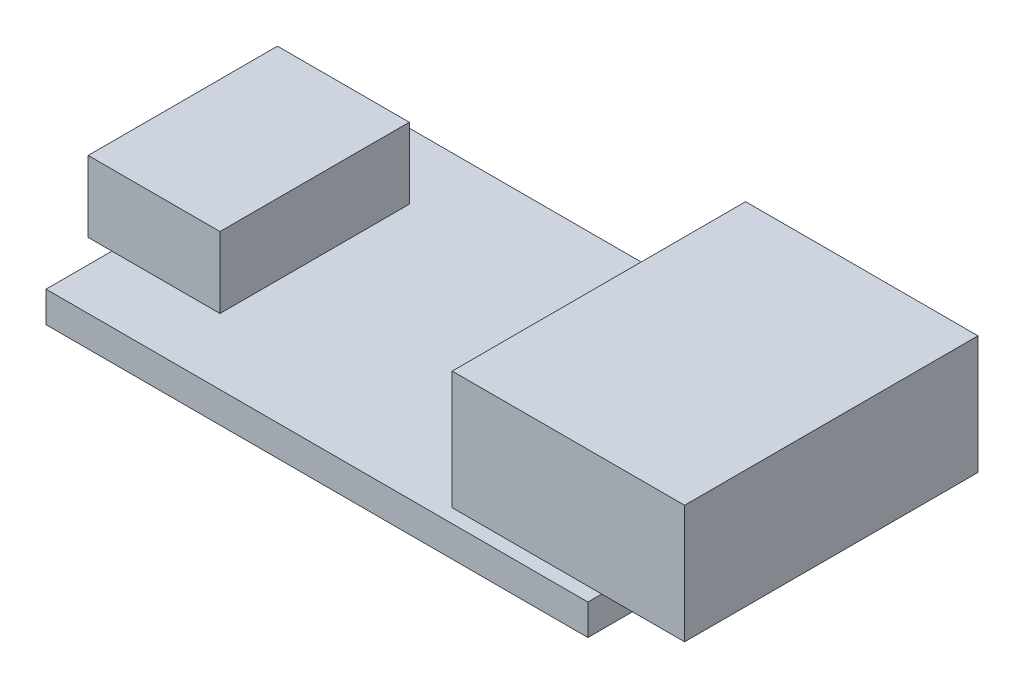
ISO-10303-21;
HEADER;
FILE_DESCRIPTION(('STEP AP214'),'2;1');
FILE_NAME('part.step','',(''),(''),'','','');
FILE_SCHEMA(('AUTOMOTIVE_DESIGN { 1 0 10303 214 1 1 1 1 }'));
ENDSEC;
DATA;
#1=APPLICATION_CONTEXT('core data for automotive mechanical design processes');
#2=APPLICATION_PROTOCOL_DEFINITION('international standard','automotive_design',2000,#1);
#3=PRODUCT_CONTEXT('',#1,'mechanical');
#4=PRODUCT('Part','Part','',(#3));
#5=PRODUCT_RELATED_PRODUCT_CATEGORY('part','',(#4));
#6=PRODUCT_DEFINITION_FORMATION('','',#4);
#7=PRODUCT_DEFINITION_CONTEXT('part definition',#1,'design');
#8=PRODUCT_DEFINITION('design','',#6,#7);
#9=PRODUCT_DEFINITION_SHAPE('','',#8);
#10=(LENGTH_UNIT() NAMED_UNIT(*) SI_UNIT(.MILLI.,.METRE.));
#11=(NAMED_UNIT(*) PLANE_ANGLE_UNIT() SI_UNIT($,.RADIAN.));
#12=(NAMED_UNIT(*) SI_UNIT($,.STERADIAN.) SOLID_ANGLE_UNIT());
#13=UNCERTAINTY_MEASURE_WITH_UNIT(LENGTH_MEASURE(1.E-05),#10,'distance_accuracy_value','');
#14=(GEOMETRIC_REPRESENTATION_CONTEXT(3) GLOBAL_UNCERTAINTY_ASSIGNED_CONTEXT((#13)) GLOBAL_UNIT_ASSIGNED_CONTEXT((#10,
#11,#12)) REPRESENTATION_CONTEXT('',''));
#15=CARTESIAN_POINT('',(0.,0.,0.));
#16=DIRECTION('',(0.,0.,1.));
#17=DIRECTION('',(1.,0.,0.));
#18=AXIS2_PLACEMENT_3D('',#15,#16,#17);
#19=CARTESIAN_POINT('',(-1.0034098301378,3.,-4.));
#20=DIRECTION('',(1.,0.,0.));
#21=DIRECTION('',(0.,0.,-1.));
#22=AXIS2_PLACEMENT_3D('',#19,#20,#21);
#23=PLANE('',#22);
#24=DIRECTION('',(0.,0.,1.));
#25=VECTOR('',#24,1.);
#26=CARTESIAN_POINT('',(-1.0034098301378,0.,-4.));
#27=LINE('',#26,#25);
#28=CARTESIAN_POINT('',(-1.0034098301378,0.,-4.));
#29=VERTEX_POINT('',#28);
#30=CARTESIAN_POINT('',(-1.0034098301378,0.,4.));
#31=VERTEX_POINT('',#30);
#32=EDGE_CURVE('E109',#29,#31,#27,.T.);
#33=ORIENTED_EDGE('',*,*,#32,.T.);
#34=DIRECTION('',(0.,-1.,0.));
#35=VECTOR('',#34,1.);
#36=CARTESIAN_POINT('',(-1.0034098301378,3.,4.));
#37=LINE('',#36,#35);
#38=CARTESIAN_POINT('',(-1.0034098301378,3.,4.));
#39=VERTEX_POINT('',#38);
#40=EDGE_CURVE('E12',#39,#31,#37,.T.);
#41=ORIENTED_EDGE('',*,*,#40,.F.);
#42=DIRECTION('',(0.,0.,1.));
#43=VECTOR('',#42,1.);
#44=CARTESIAN_POINT('',(-1.0034098301378,3.,-4.));
#45=LINE('',#44,#43);
#46=CARTESIAN_POINT('',(-1.0034098301378,3.,-4.));
#47=VERTEX_POINT('',#46);
#48=EDGE_CURVE('E95',#47,#39,#45,.T.);
#49=ORIENTED_EDGE('',*,*,#48,.F.);
#50=DIRECTION('',(0.,-1.,0.));
#51=VECTOR('',#50,1.);
#52=CARTESIAN_POINT('',(-1.0034098301378,3.,-4.));
#53=LINE('',#52,#51);
#54=EDGE_CURVE('E62',#47,#29,#53,.T.);
#55=ORIENTED_EDGE('',*,*,#54,.T.);
#56=EDGE_LOOP('',(#33,#41,#49,#55));
#57=FACE_BOUND('',#56,.T.);
#58=ADVANCED_FACE('F46',(#57),#23,.F.);
#59=CARTESIAN_POINT('',(-1.0034098301378,3.,4.));
#60=DIRECTION('',(0.,0.,-1.));
#61=DIRECTION('',(-1.,0.,0.));
#62=AXIS2_PLACEMENT_3D('',#59,#60,#61);
#63=PLANE('',#62);
#64=DIRECTION('',(1.,0.,0.));
#65=VECTOR('',#64,1.);
#66=CARTESIAN_POINT('',(-1.0034098301378,0.,4.));
#67=LINE('',#66,#65);
#68=CARTESIAN_POINT('',(4.5665901698622,0.,4.));
#69=VERTEX_POINT('',#68);
#70=EDGE_CURVE('E100',#31,#69,#67,.T.);
#71=ORIENTED_EDGE('',*,*,#70,.T.);
#72=DIRECTION('',(0.,-1.,0.));
#73=VECTOR('',#72,1.);
#74=CARTESIAN_POINT('',(4.5665901698622,3.,4.));
#75=LINE('',#74,#73);
#76=CARTESIAN_POINT('',(4.5665901698622,3.,4.));
#77=VERTEX_POINT('',#76);
#78=EDGE_CURVE('E54',#77,#69,#75,.T.);
#79=ORIENTED_EDGE('',*,*,#78,.F.);
#80=DIRECTION('',(1.,0.,0.));
#81=VECTOR('',#80,1.);
#82=CARTESIAN_POINT('',(-1.0034098301378,3.,4.));
#83=LINE('',#82,#81);
#84=EDGE_CURVE('E87',#39,#77,#83,.T.);
#85=ORIENTED_EDGE('',*,*,#84,.F.);
#86=ORIENTED_EDGE('',*,*,#40,.T.);
#87=EDGE_LOOP('',(#71,#79,#85,#86));
#88=FACE_BOUND('',#87,.T.);
#89=ADVANCED_FACE('F99',(#88),#63,.F.);
#90=CARTESIAN_POINT('',(4.5665901698622,3.,-4.));
#91=DIRECTION('',(1.,0.,0.));
#92=DIRECTION('',(0.,0.,-1.));
#93=AXIS2_PLACEMENT_3D('',#90,#91,#92);
#94=PLANE('',#93);
#95=DIRECTION('',(0.,0.,1.));
#96=VECTOR('',#95,1.);
#97=CARTESIAN_POINT('',(4.5665901698622,0.,-4.));
#98=LINE('',#97,#96);
#99=CARTESIAN_POINT('',(4.5665901698622,0.,-4.));
#100=VERTEX_POINT('',#99);
#101=EDGE_CURVE('E112',#100,#69,#98,.T.);
#102=ORIENTED_EDGE('',*,*,#101,.F.);
#103=DIRECTION('',(0.,-1.,0.));
#104=VECTOR('',#103,1.);
#105=CARTESIAN_POINT('',(4.5665901698622,3.,-4.));
#106=LINE('',#105,#104);
#107=CARTESIAN_POINT('',(4.5665901698622,3.,-4.));
#108=VERTEX_POINT('',#107);
#109=EDGE_CURVE('E76',#108,#100,#106,.T.);
#110=ORIENTED_EDGE('',*,*,#109,.F.);
#111=DIRECTION('',(0.,0.,1.));
#112=VECTOR('',#111,1.);
#113=CARTESIAN_POINT('',(4.5665901698622,3.,-4.));
#114=LINE('',#113,#112);
#115=EDGE_CURVE('E94',#108,#77,#114,.T.);
#116=ORIENTED_EDGE('',*,*,#115,.T.);
#117=ORIENTED_EDGE('',*,*,#78,.T.);
#118=EDGE_LOOP('',(#102,#110,#116,#117));
#119=FACE_BOUND('',#118,.T.);
#120=ADVANCED_FACE('F103',(#119),#94,.T.);
#121=CARTESIAN_POINT('',(-1.0034098301378,3.,-4.));
#122=DIRECTION('',(0.,0.,-1.));
#123=DIRECTION('',(-1.,0.,0.));
#124=AXIS2_PLACEMENT_3D('',#121,#122,#123);
#125=PLANE('',#124);
#126=DIRECTION('',(1.,0.,0.));
#127=VECTOR('',#126,1.);
#128=CARTESIAN_POINT('',(-1.0034098301378,0.,-4.));
#129=LINE('',#128,#127);
#130=EDGE_CURVE('E114',#29,#100,#129,.T.);
#131=ORIENTED_EDGE('',*,*,#130,.F.);
#132=ORIENTED_EDGE('',*,*,#54,.F.);
#133=DIRECTION('',(1.,0.,0.));
#134=VECTOR('',#133,1.);
#135=CARTESIAN_POINT('',(-1.0034098301378,3.,-4.));
#136=LINE('',#135,#134);
#137=EDGE_CURVE('E104',#47,#108,#136,.T.);
#138=ORIENTED_EDGE('',*,*,#137,.T.);
#139=ORIENTED_EDGE('',*,*,#109,.T.);
#140=EDGE_LOOP('',(#131,#132,#138,#139));
#141=FACE_BOUND('',#140,.T.);
#142=ADVANCED_FACE('F120',(#141),#125,.T.);
#143=CARTESIAN_POINT('',(0.,3.,0.));
#144=DIRECTION('',(0.,1.,0.));
#145=DIRECTION('',(0.,0.,1.));
#146=AXIS2_PLACEMENT_3D('',#143,#144,#145);
#147=PLANE('',#146);
#148=ORIENTED_EDGE('',*,*,#48,.T.);
#149=ORIENTED_EDGE('',*,*,#84,.T.);
#150=ORIENTED_EDGE('',*,*,#115,.F.);
#151=ORIENTED_EDGE('',*,*,#137,.F.);
#152=EDGE_LOOP('',(#148,#149,#150,#151));
#153=FACE_BOUND('',#152,.T.);
#154=ADVANCED_FACE('F91',(#153),#147,.T.);
#155=CARTESIAN_POINT('',(0.,0.,0.));
#156=DIRECTION('',(0.,1.,0.));
#157=DIRECTION('',(0.,0.,1.));
#158=AXIS2_PLACEMENT_3D('',#155,#156,#157);
#159=PLANE('',#158);
#160=ORIENTED_EDGE('',*,*,#32,.F.);
#161=ORIENTED_EDGE('',*,*,#130,.T.);
#162=ORIENTED_EDGE('',*,*,#101,.T.);
#163=ORIENTED_EDGE('',*,*,#70,.F.);
#164=EDGE_LOOP('',(#160,#161,#162,#163));
#165=FACE_BOUND('',#164,.T.);
#166=ADVANCED_FACE('F119',(#165),#159,.F.);
#167=CLOSED_SHELL('',(#58,#89,#120,#142,#154,#166));
#168=MANIFOLD_SOLID_BREP('B2',#167);
#169=CARTESIAN_POINT('',(26.4,5.,-6.2));
#170=DIRECTION('',(0.,0.,1.));
#171=DIRECTION('',(1.,0.,0.));
#172=AXIS2_PLACEMENT_3D('',#169,#170,#171);
#173=PLANE('',#172);
#174=DIRECTION('',(-1.,0.,0.));
#175=VECTOR('',#174,1.);
#176=CARTESIAN_POINT('',(26.4,0.,-6.2));
#177=LINE('',#176,#175);
#178=CARTESIAN_POINT('',(26.4,0.,-6.2));
#179=VERTEX_POINT('',#178);
#180=CARTESIAN_POINT('',(16.58,0.,-6.2));
#181=VERTEX_POINT('',#180);
#182=EDGE_CURVE('E242',#179,#181,#177,.T.);
#183=ORIENTED_EDGE('',*,*,#182,.T.);
#184=DIRECTION('',(0.,-1.,0.));
#185=VECTOR('',#184,1.);
#186=CARTESIAN_POINT('',(16.58,5.,-6.2));
#187=LINE('',#186,#185);
#188=CARTESIAN_POINT('',(16.58,5.,-6.2));
#189=VERTEX_POINT('',#188);
#190=EDGE_CURVE('E44',#189,#181,#187,.T.);
#191=ORIENTED_EDGE('',*,*,#190,.F.);
#192=DIRECTION('',(-1.,0.,0.));
#193=VECTOR('',#192,1.);
#194=CARTESIAN_POINT('',(26.4,5.,-6.2));
#195=LINE('',#194,#193);
#196=CARTESIAN_POINT('',(26.4,5.,-6.2));
#197=VERTEX_POINT('',#196);
#198=EDGE_CURVE('E228',#197,#189,#195,.T.);
#199=ORIENTED_EDGE('',*,*,#198,.F.);
#200=DIRECTION('',(0.,-1.,0.));
#201=VECTOR('',#200,1.);
#202=CARTESIAN_POINT('',(26.4,5.,-6.2));
#203=LINE('',#202,#201);
#204=EDGE_CURVE('E195',#197,#179,#203,.T.);
#205=ORIENTED_EDGE('',*,*,#204,.T.);
#206=EDGE_LOOP('',(#183,#191,#199,#205));
#207=FACE_BOUND('',#206,.T.);
#208=ADVANCED_FACE('F179',(#207),#173,.F.);
#209=CARTESIAN_POINT('',(16.58,5.,-6.2));
#210=DIRECTION('',(1.,0.,0.));
#211=DIRECTION('',(0.,0.,-1.));
#212=AXIS2_PLACEMENT_3D('',#209,#210,#211);
#213=PLANE('',#212);
#214=DIRECTION('',(0.,0.,1.));
#215=VECTOR('',#214,1.);
#216=CARTESIAN_POINT('',(16.58,0.,-6.2));
#217=LINE('',#216,#215);
#218=CARTESIAN_POINT('',(16.58,0.,6.2));
#219=VERTEX_POINT('',#218);
#220=EDGE_CURVE('E233',#181,#219,#217,.T.);
#221=ORIENTED_EDGE('',*,*,#220,.T.);
#222=DIRECTION('',(0.,-1.,0.));
#223=VECTOR('',#222,1.);
#224=CARTESIAN_POINT('',(16.58,5.,6.2));
#225=LINE('',#224,#223);
#226=CARTESIAN_POINT('',(16.58,5.,6.2));
#227=VERTEX_POINT('',#226);
#228=EDGE_CURVE('E187',#227,#219,#225,.T.);
#229=ORIENTED_EDGE('',*,*,#228,.F.);
#230=DIRECTION('',(0.,0.,1.));
#231=VECTOR('',#230,1.);
#232=CARTESIAN_POINT('',(16.58,5.,-6.2));
#233=LINE('',#232,#231);
#234=EDGE_CURVE('E220',#189,#227,#233,.T.);
#235=ORIENTED_EDGE('',*,*,#234,.F.);
#236=ORIENTED_EDGE('',*,*,#190,.T.);
#237=EDGE_LOOP('',(#221,#229,#235,#236));
#238=FACE_BOUND('',#237,.T.);
#239=ADVANCED_FACE('F232',(#238),#213,.F.);
#240=CARTESIAN_POINT('',(26.4,5.,6.2));
#241=DIRECTION('',(0.,0.,1.));
#242=DIRECTION('',(1.,0.,0.));
#243=AXIS2_PLACEMENT_3D('',#240,#241,#242);
#244=PLANE('',#243);
#245=DIRECTION('',(-1.,0.,0.));
#246=VECTOR('',#245,1.);
#247=CARTESIAN_POINT('',(26.4,0.,6.2));
#248=LINE('',#247,#246);
#249=CARTESIAN_POINT('',(26.4,0.,6.2));
#250=VERTEX_POINT('',#249);
#251=EDGE_CURVE('E245',#250,#219,#248,.T.);
#252=ORIENTED_EDGE('',*,*,#251,.F.);
#253=DIRECTION('',(0.,-1.,0.));
#254=VECTOR('',#253,1.);
#255=CARTESIAN_POINT('',(26.4,5.,6.2));
#256=LINE('',#255,#254);
#257=CARTESIAN_POINT('',(26.4,5.,6.2));
#258=VERTEX_POINT('',#257);
#259=EDGE_CURVE('E209',#258,#250,#256,.T.);
#260=ORIENTED_EDGE('',*,*,#259,.F.);
#261=DIRECTION('',(-1.,0.,0.));
#262=VECTOR('',#261,1.);
#263=CARTESIAN_POINT('',(26.4,5.,6.2));
#264=LINE('',#263,#262);
#265=EDGE_CURVE('E227',#258,#227,#264,.T.);
#266=ORIENTED_EDGE('',*,*,#265,.T.);
#267=ORIENTED_EDGE('',*,*,#228,.T.);
#268=EDGE_LOOP('',(#252,#260,#266,#267));
#269=FACE_BOUND('',#268,.T.);
#270=ADVANCED_FACE('F236',(#269),#244,.T.);
#271=CARTESIAN_POINT('',(26.4,5.,-6.2));
#272=DIRECTION('',(1.,0.,0.));
#273=DIRECTION('',(0.,0.,-1.));
#274=AXIS2_PLACEMENT_3D('',#271,#272,#273);
#275=PLANE('',#274);
#276=DIRECTION('',(0.,0.,1.));
#277=VECTOR('',#276,1.);
#278=CARTESIAN_POINT('',(26.4,0.,-6.2));
#279=LINE('',#278,#277);
#280=EDGE_CURVE('E247',#179,#250,#279,.T.);
#281=ORIENTED_EDGE('',*,*,#280,.F.);
#282=ORIENTED_EDGE('',*,*,#204,.F.);
#283=DIRECTION('',(0.,0.,1.));
#284=VECTOR('',#283,1.);
#285=CARTESIAN_POINT('',(26.4,5.,-6.2));
#286=LINE('',#285,#284);
#287=EDGE_CURVE('E237',#197,#258,#286,.T.);
#288=ORIENTED_EDGE('',*,*,#287,.T.);
#289=ORIENTED_EDGE('',*,*,#259,.T.);
#290=EDGE_LOOP('',(#281,#282,#288,#289));
#291=FACE_BOUND('',#290,.T.);
#292=ADVANCED_FACE('F253',(#291),#275,.T.);
#293=CARTESIAN_POINT('',(0.,5.,0.));
#294=DIRECTION('',(0.,1.,0.));
#295=DIRECTION('',(0.,0.,1.));
#296=AXIS2_PLACEMENT_3D('',#293,#294,#295);
#297=PLANE('',#296);
#298=ORIENTED_EDGE('',*,*,#198,.T.);
#299=ORIENTED_EDGE('',*,*,#234,.T.);
#300=ORIENTED_EDGE('',*,*,#265,.F.);
#301=ORIENTED_EDGE('',*,*,#287,.F.);
#302=EDGE_LOOP('',(#298,#299,#300,#301));
#303=FACE_BOUND('',#302,.T.);
#304=ADVANCED_FACE('F224',(#303),#297,.T.);
#305=CARTESIAN_POINT('',(0.,0.,0.));
#306=DIRECTION('',(0.,1.,0.));
#307=DIRECTION('',(0.,0.,1.));
#308=AXIS2_PLACEMENT_3D('',#305,#306,#307);
#309=PLANE('',#308);
#310=ORIENTED_EDGE('',*,*,#182,.F.);
#311=ORIENTED_EDGE('',*,*,#280,.T.);
#312=ORIENTED_EDGE('',*,*,#251,.T.);
#313=ORIENTED_EDGE('',*,*,#220,.F.);
#314=EDGE_LOOP('',(#310,#311,#312,#313));
#315=FACE_BOUND('',#314,.T.);
#316=ADVANCED_FACE('F252',(#315),#309,.F.);
#317=CLOSED_SHELL('',(#208,#239,#270,#292,#304,#316));
#318=MANIFOLD_SOLID_BREP('B6',#317);
#319=CARTESIAN_POINT('',(0.,-1.3,-6.785));
#320=DIRECTION('',(-1.,0.,0.));
#321=DIRECTION('',(0.,0.,1.));
#322=AXIS2_PLACEMENT_3D('',#319,#320,#321);
#323=PLANE('',#322);
#324=DIRECTION('',(0.,0.,1.));
#325=VECTOR('',#324,1.);
#326=CARTESIAN_POINT('',(0.,0.,-6.785));
#327=LINE('',#326,#325);
#328=CARTESIAN_POINT('',(0.,0.,-6.785));
#329=VERTEX_POINT('',#328);
#330=CARTESIAN_POINT('',(0.,0.,6.78500000000001));
#331=VERTEX_POINT('',#330);
#332=EDGE_CURVE('E368',#329,#331,#327,.T.);
#333=ORIENTED_EDGE('',*,*,#332,.F.);
#334=DIRECTION('',(0.,1.,0.));
#335=VECTOR('',#334,1.);
#336=CARTESIAN_POINT('',(0.,-1.3,-6.785));
#337=LINE('',#336,#335);
#338=CARTESIAN_POINT('',(0.,-1.3,-6.785));
#339=VERTEX_POINT('',#338);
#340=EDGE_CURVE('E177',#339,#329,#337,.T.);
#341=ORIENTED_EDGE('',*,*,#340,.F.);
#342=DIRECTION('',(0.,0.,1.));
#343=VECTOR('',#342,1.);
#344=CARTESIAN_POINT('',(0.,-1.3,-6.785));
#345=LINE('',#344,#343);
#346=CARTESIAN_POINT('',(0.,-1.3,6.78500000000001));
#347=VERTEX_POINT('',#346);
#348=EDGE_CURVE('E363',#339,#347,#345,.T.);
#349=ORIENTED_EDGE('',*,*,#348,.T.);
#350=DIRECTION('',(0.,1.,0.));
#351=VECTOR('',#350,1.);
#352=CARTESIAN_POINT('',(0.,-1.3,6.78500000000001));
#353=LINE('',#352,#351);
#354=EDGE_CURVE('E306',#347,#331,#353,.T.);
#355=ORIENTED_EDGE('',*,*,#354,.T.);
#356=EDGE_LOOP('',(#333,#341,#349,#355));
#357=FACE_BOUND('',#356,.T.);
#358=ADVANCED_FACE('F303',(#357),#323,.T.);
#359=CARTESIAN_POINT('',(0.,-1.3,-6.785));
#360=DIRECTION('',(0.,0.,1.));
#361=DIRECTION('',(1.,0.,0.));
#362=AXIS2_PLACEMENT_3D('',#359,#360,#361);
#363=PLANE('',#362);
#364=DIRECTION('',(1.,0.,0.));
#365=VECTOR('',#364,1.);
#366=CARTESIAN_POINT('',(0.,0.,-6.785));
#367=LINE('',#366,#365);
#368=CARTESIAN_POINT('',(22.9,0.,-6.78499999999999));
#369=VERTEX_POINT('',#368);
#370=EDGE_CURVE('E336',#329,#369,#367,.T.);
#371=ORIENTED_EDGE('',*,*,#370,.T.);
#372=DIRECTION('',(0.,1.,0.));
#373=VECTOR('',#372,1.);
#374=CARTESIAN_POINT('',(22.9,-1.3,-6.78499999999999));
#375=LINE('',#374,#373);
#376=CARTESIAN_POINT('',(22.9,-1.3,-6.78499999999999));
#377=VERTEX_POINT('',#376);
#378=EDGE_CURVE('E312',#377,#369,#375,.T.);
#379=ORIENTED_EDGE('',*,*,#378,.F.);
#380=DIRECTION('',(1.,0.,0.));
#381=VECTOR('',#380,1.);
#382=CARTESIAN_POINT('',(0.,-1.3,-6.785));
#383=LINE('',#382,#381);
#384=EDGE_CURVE('E353',#339,#377,#383,.T.);
#385=ORIENTED_EDGE('',*,*,#384,.F.);
#386=ORIENTED_EDGE('',*,*,#340,.T.);
#387=EDGE_LOOP('',(#371,#379,#385,#386));
#388=FACE_BOUND('',#387,.T.);
#389=ADVANCED_FACE('F378',(#388),#363,.F.);
#390=CARTESIAN_POINT('',(22.9,-1.3,-6.78499999999999));
#391=DIRECTION('',(-1.,0.,0.));
#392=DIRECTION('',(0.,0.,1.));
#393=AXIS2_PLACEMENT_3D('',#390,#391,#392);
#394=PLANE('',#393);
#395=DIRECTION('',(0.,0.,1.));
#396=VECTOR('',#395,1.);
#397=CARTESIAN_POINT('',(22.9,0.,-6.78499999999999));
#398=LINE('',#397,#396);
#399=CARTESIAN_POINT('',(22.9,0.,6.78500000000001));
#400=VERTEX_POINT('',#399);
#401=EDGE_CURVE('E360',#369,#400,#398,.T.);
#402=ORIENTED_EDGE('',*,*,#401,.T.);
#403=DIRECTION('',(0.,1.,0.));
#404=VECTOR('',#403,1.);
#405=CARTESIAN_POINT('',(22.9,-1.3,6.78500000000001));
#406=LINE('',#405,#404);
#407=CARTESIAN_POINT('',(22.9,-1.3,6.78500000000001));
#408=VERTEX_POINT('',#407);
#409=EDGE_CURVE('E357',#408,#400,#406,.T.);
#410=ORIENTED_EDGE('',*,*,#409,.F.);
#411=DIRECTION('',(0.,0.,1.));
#412=VECTOR('',#411,1.);
#413=CARTESIAN_POINT('',(22.9,-1.3,-6.78499999999999));
#414=LINE('',#413,#412);
#415=EDGE_CURVE('E348',#377,#408,#414,.T.);
#416=ORIENTED_EDGE('',*,*,#415,.F.);
#417=ORIENTED_EDGE('',*,*,#378,.T.);
#418=EDGE_LOOP('',(#402,#410,#416,#417));
#419=FACE_BOUND('',#418,.T.);
#420=ADVANCED_FACE('F358',(#419),#394,.F.);
#421=CARTESIAN_POINT('',(0.,-1.3,6.78500000000001));
#422=DIRECTION('',(0.,0.,1.));
#423=DIRECTION('',(1.,0.,0.));
#424=AXIS2_PLACEMENT_3D('',#421,#422,#423);
#425=PLANE('',#424);
#426=DIRECTION('',(1.,0.,0.));
#427=VECTOR('',#426,1.);
#428=CARTESIAN_POINT('',(0.,0.,6.78500000000001));
#429=LINE('',#428,#427);
#430=EDGE_CURVE('E371',#331,#400,#429,.T.);
#431=ORIENTED_EDGE('',*,*,#430,.F.);
#432=ORIENTED_EDGE('',*,*,#354,.F.);
#433=DIRECTION('',(1.,0.,0.));
#434=VECTOR('',#433,1.);
#435=CARTESIAN_POINT('',(0.,-1.3,6.78500000000001));
#436=LINE('',#435,#434);
#437=EDGE_CURVE('E352',#347,#408,#436,.T.);
#438=ORIENTED_EDGE('',*,*,#437,.T.);
#439=ORIENTED_EDGE('',*,*,#409,.T.);
#440=EDGE_LOOP('',(#431,#432,#438,#439));
#441=FACE_BOUND('',#440,.T.);
#442=ADVANCED_FACE('F362',(#441),#425,.T.);
#443=CARTESIAN_POINT('',(0.,-1.3,0.));
#444=DIRECTION('',(0.,1.,0.));
#445=DIRECTION('',(0.,0.,1.));
#446=AXIS2_PLACEMENT_3D('',#443,#444,#445);
#447=PLANE('',#446);
#448=ORIENTED_EDGE('',*,*,#348,.F.);
#449=ORIENTED_EDGE('',*,*,#384,.T.);
#450=ORIENTED_EDGE('',*,*,#415,.T.);
#451=ORIENTED_EDGE('',*,*,#437,.F.);
#452=EDGE_LOOP('',(#448,#449,#450,#451));
#453=FACE_BOUND('',#452,.T.);
#454=ADVANCED_FACE('F351',(#453),#447,.F.);
#455=CARTESIAN_POINT('',(0.,0.,0.));
#456=DIRECTION('',(0.,1.,0.));
#457=DIRECTION('',(0.,0.,1.));
#458=AXIS2_PLACEMENT_3D('',#455,#456,#457);
#459=PLANE('',#458);
#460=ORIENTED_EDGE('',*,*,#332,.T.);
#461=ORIENTED_EDGE('',*,*,#430,.T.);
#462=ORIENTED_EDGE('',*,*,#401,.F.);
#463=ORIENTED_EDGE('',*,*,#370,.F.);
#464=EDGE_LOOP('',(#460,#461,#462,#463));
#465=FACE_BOUND('',#464,.T.);
#466=ADVANCED_FACE('F376',(#465),#459,.T.);
#467=CLOSED_SHELL('',(#358,#389,#420,#442,#454,#466));
#468=MANIFOLD_SOLID_BREP('B38',#467);
#469=ADVANCED_BREP_SHAPE_REPRESENTATION('',(#18,#168,#318,#468),#14);
#470=SHAPE_DEFINITION_REPRESENTATION(#9,#469);
ENDSEC;
END-ISO-10303-21;
